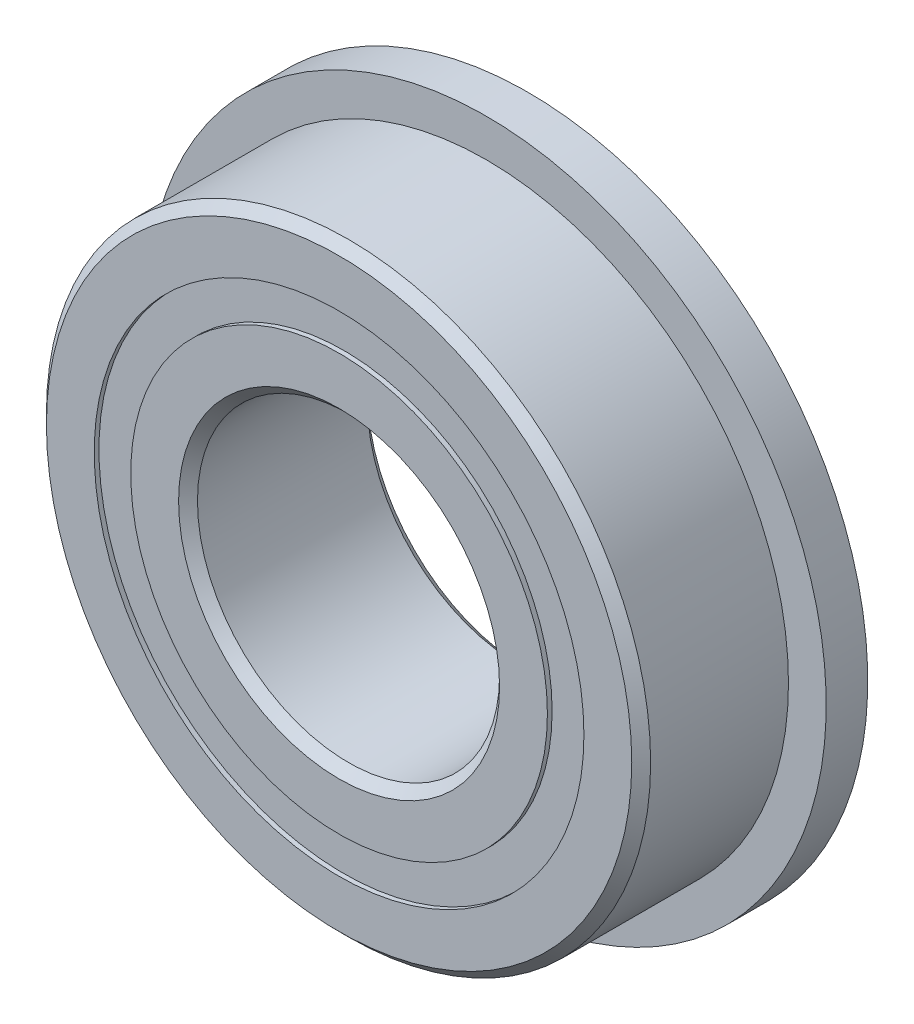
ISO-10303-21;
HEADER;
FILE_DESCRIPTION(('STEP AP214'),'2;1');
FILE_NAME('part.step','',(''),(''),'','','');
FILE_SCHEMA(('AUTOMOTIVE_DESIGN { 1 0 10303 214 1 1 1 1 }'));
ENDSEC;
DATA;
#1=APPLICATION_CONTEXT('core data for automotive mechanical design processes');
#2=APPLICATION_PROTOCOL_DEFINITION('international standard','automotive_design',2000,#1);
#3=PRODUCT_CONTEXT('',#1,'mechanical');
#4=PRODUCT('Part','Part','',(#3));
#5=PRODUCT_RELATED_PRODUCT_CATEGORY('part','',(#4));
#6=PRODUCT_DEFINITION_FORMATION('','',#4);
#7=PRODUCT_DEFINITION_CONTEXT('part definition',#1,'design');
#8=PRODUCT_DEFINITION('design','',#6,#7);
#9=PRODUCT_DEFINITION_SHAPE('','',#8);
#10=(LENGTH_UNIT() NAMED_UNIT(*) SI_UNIT(.MILLI.,.METRE.));
#11=(NAMED_UNIT(*) PLANE_ANGLE_UNIT() SI_UNIT($,.RADIAN.));
#12=(NAMED_UNIT(*) SI_UNIT($,.STERADIAN.) SOLID_ANGLE_UNIT());
#13=UNCERTAINTY_MEASURE_WITH_UNIT(LENGTH_MEASURE(1.E-05),#10,'distance_accuracy_value','');
#14=(GEOMETRIC_REPRESENTATION_CONTEXT(3) GLOBAL_UNCERTAINTY_ASSIGNED_CONTEXT((#13)) GLOBAL_UNIT_ASSIGNED_CONTEXT((#10,
#11,#12)) REPRESENTATION_CONTEXT('',''));
#15=CARTESIAN_POINT('',(0.,0.,0.));
#16=DIRECTION('',(0.,0.,1.));
#17=DIRECTION('',(1.,0.,0.));
#18=AXIS2_PLACEMENT_3D('',#15,#16,#17);
#19=CARTESIAN_POINT('',(0.,6.48351648351648,-2.375));
#20=DIRECTION('',(0.,0.,1.));
#21=DIRECTION('',(1.,0.,0.));
#22=AXIS2_PLACEMENT_3D('',#19,#20,#21);
#23=PLANE('',#22);
#24=CARTESIAN_POINT('',(0.,0.,-2.375));
#25=DIRECTION('',(0.,0.,1.));
#26=DIRECTION('',(1.,0.,0.));
#27=AXIS2_PLACEMENT_3D('',#24,#25,#26);
#28=CIRCLE('',#27,6.48351648351648);
#29=CARTESIAN_POINT('',(6.48351648351648,0.,-2.375));
#30=VERTEX_POINT('',#29);
#31=EDGE_CURVE('E61',#30,#30,#28,.T.);
#32=ORIENTED_EDGE('',*,*,#31,.F.);
#33=EDGE_LOOP('',(#32));
#34=FACE_BOUND('',#33,.T.);
#35=CARTESIAN_POINT('',(0.,0.,-2.375));
#36=DIRECTION('',(0.,0.,1.));
#37=DIRECTION('',(1.,0.,0.));
#38=AXIS2_PLACEMENT_3D('',#35,#36,#37);
#39=CIRCLE('',#38,5.51648351648352);
#40=CARTESIAN_POINT('',(5.51648351648352,0.,-2.375));
#41=VERTEX_POINT('',#40);
#42=EDGE_CURVE('E11',#41,#41,#39,.T.);
#43=ORIENTED_EDGE('',*,*,#42,.T.);
#44=EDGE_LOOP('',(#43));
#45=FACE_BOUND('',#44,.T.);
#46=ADVANCED_FACE('F47',(#34,#45),#23,.F.);
#47=CARTESIAN_POINT('',(0.,0.,2.5));
#48=DIRECTION('',(0.,0.,1.));
#49=DIRECTION('',(1.,0.,0.));
#50=AXIS2_PLACEMENT_3D('',#47,#48,#49);
#51=CYLINDRICAL_SURFACE('',#50,5.51648351648352);
#52=ORIENTED_EDGE('',*,*,#42,.F.);
#53=EDGE_LOOP('',(#52));
#54=FACE_BOUND('',#53,.T.);
#55=CARTESIAN_POINT('',(0.,0.,-1.21175743903915));
#56=DIRECTION('',(0.,0.,1.));
#57=DIRECTION('',(1.,0.,0.));
#58=AXIS2_PLACEMENT_3D('',#55,#56,#57);
#59=CIRCLE('',#58,5.51648351648352);
#60=CARTESIAN_POINT('',(5.51648351648352,0.,-1.21175743903915));
#61=VERTEX_POINT('',#60);
#62=EDGE_CURVE('E53',#61,#61,#59,.T.);
#63=ORIENTED_EDGE('',*,*,#62,.T.);
#64=EDGE_LOOP('',(#63));
#65=FACE_BOUND('',#64,.T.);
#66=ADVANCED_FACE('F70',(#54,#65),#51,.F.);
#67=CARTESIAN_POINT('',(0.,6.48351648351648,-1.21175743903915));
#68=DIRECTION('',(0.,0.,-1.));
#69=DIRECTION('',(-1.,0.,0.));
#70=AXIS2_PLACEMENT_3D('',#67,#68,#69);
#71=PLANE('',#70);
#72=ORIENTED_EDGE('',*,*,#62,.F.);
#73=EDGE_LOOP('',(#72));
#74=FACE_BOUND('',#73,.T.);
#75=CARTESIAN_POINT('',(0.,0.,-1.21175743903915));
#76=DIRECTION('',(0.,0.,1.));
#77=DIRECTION('',(1.,0.,0.));
#78=AXIS2_PLACEMENT_3D('',#75,#76,#77);
#79=CIRCLE('',#78,6.48351648351648);
#80=CARTESIAN_POINT('',(6.48351648351648,0.,-1.21175743903915));
#81=VERTEX_POINT('',#80);
#82=EDGE_CURVE('E57',#81,#81,#79,.T.);
#83=ORIENTED_EDGE('',*,*,#82,.T.);
#84=EDGE_LOOP('',(#83));
#85=FACE_BOUND('',#84,.T.);
#86=ADVANCED_FACE('F74',(#74,#85),#71,.F.);
#87=CARTESIAN_POINT('',(0.,0.,2.5));
#88=DIRECTION('',(0.,0.,1.));
#89=DIRECTION('',(1.,0.,0.));
#90=AXIS2_PLACEMENT_3D('',#87,#88,#89);
#91=CYLINDRICAL_SURFACE('',#90,6.48351648351648);
#92=ORIENTED_EDGE('',*,*,#82,.F.);
#93=EDGE_LOOP('',(#92));
#94=FACE_BOUND('',#93,.T.);
#95=ORIENTED_EDGE('',*,*,#31,.T.);
#96=EDGE_LOOP('',(#95));
#97=FACE_BOUND('',#96,.T.);
#98=ADVANCED_FACE('F67',(#94,#97),#91,.T.);
#99=CLOSED_SHELL('',(#46,#66,#86,#98));
#100=MANIFOLD_SOLID_BREP('B2',#99);
#101=CARTESIAN_POINT('',(0.,6.48351648351648,2.375));
#102=DIRECTION('',(0.,0.,-1.));
#103=DIRECTION('',(-1.,0.,0.));
#104=AXIS2_PLACEMENT_3D('',#101,#102,#103);
#105=PLANE('',#104);
#106=CARTESIAN_POINT('',(0.,0.,2.375));
#107=DIRECTION('',(0.,0.,1.));
#108=DIRECTION('',(1.,0.,0.));
#109=AXIS2_PLACEMENT_3D('',#106,#107,#108);
#110=CIRCLE('',#109,5.51648351648352);
#111=CARTESIAN_POINT('',(5.51648351648352,0.,2.375));
#112=VERTEX_POINT('',#111);
#113=EDGE_CURVE('E46',#112,#112,#110,.T.);
#114=ORIENTED_EDGE('',*,*,#113,.F.);
#115=EDGE_LOOP('',(#114));
#116=FACE_BOUND('',#115,.T.);
#117=CARTESIAN_POINT('',(0.,0.,2.375));
#118=DIRECTION('',(0.,0.,1.));
#119=DIRECTION('',(1.,0.,0.));
#120=AXIS2_PLACEMENT_3D('',#117,#118,#119);
#121=CIRCLE('',#120,6.48351648351648);
#122=CARTESIAN_POINT('',(6.48351648351648,0.,2.375));
#123=VERTEX_POINT('',#122);
#124=EDGE_CURVE('E129',#123,#123,#121,.T.);
#125=ORIENTED_EDGE('',*,*,#124,.T.);
#126=EDGE_LOOP('',(#125));
#127=FACE_BOUND('',#126,.T.);
#128=ADVANCED_FACE('F115',(#116,#127),#105,.F.);
#129=CARTESIAN_POINT('',(0.,0.,2.5));
#130=DIRECTION('',(0.,0.,1.));
#131=DIRECTION('',(1.,0.,0.));
#132=AXIS2_PLACEMENT_3D('',#129,#130,#131);
#133=CYLINDRICAL_SURFACE('',#132,5.51648351648352);
#134=CARTESIAN_POINT('',(0.,0.,1.21175743903915));
#135=DIRECTION('',(0.,0.,1.));
#136=DIRECTION('',(1.,0.,0.));
#137=AXIS2_PLACEMENT_3D('',#134,#135,#136);
#138=CIRCLE('',#137,5.51648351648352);
#139=CARTESIAN_POINT('',(5.51648351648352,0.,1.21175743903915));
#140=VERTEX_POINT('',#139);
#141=EDGE_CURVE('E121',#140,#140,#138,.T.);
#142=ORIENTED_EDGE('',*,*,#141,.F.);
#143=EDGE_LOOP('',(#142));
#144=FACE_BOUND('',#143,.T.);
#145=ORIENTED_EDGE('',*,*,#113,.T.);
#146=EDGE_LOOP('',(#145));
#147=FACE_BOUND('',#146,.T.);
#148=ADVANCED_FACE('F144',(#144,#147),#133,.F.);
#149=CARTESIAN_POINT('',(0.,6.48351648351648,1.21175743903915));
#150=DIRECTION('',(0.,0.,1.));
#151=DIRECTION('',(1.,0.,0.));
#152=AXIS2_PLACEMENT_3D('',#149,#150,#151);
#153=PLANE('',#152);
#154=CARTESIAN_POINT('',(0.,0.,1.21175743903915));
#155=DIRECTION('',(0.,0.,1.));
#156=DIRECTION('',(1.,0.,0.));
#157=AXIS2_PLACEMENT_3D('',#154,#155,#156);
#158=CIRCLE('',#157,6.48351648351648);
#159=CARTESIAN_POINT('',(6.48351648351648,0.,1.21175743903915));
#160=VERTEX_POINT('',#159);
#161=EDGE_CURVE('E125',#160,#160,#158,.T.);
#162=ORIENTED_EDGE('',*,*,#161,.F.);
#163=EDGE_LOOP('',(#162));
#164=FACE_BOUND('',#163,.T.);
#165=ORIENTED_EDGE('',*,*,#141,.T.);
#166=EDGE_LOOP('',(#165));
#167=FACE_BOUND('',#166,.T.);
#168=ADVANCED_FACE('F139',(#164,#167),#153,.F.);
#169=CARTESIAN_POINT('',(0.,0.,2.5));
#170=DIRECTION('',(0.,0.,1.));
#171=DIRECTION('',(1.,0.,0.));
#172=AXIS2_PLACEMENT_3D('',#169,#170,#171);
#173=CYLINDRICAL_SURFACE('',#172,6.48351648351648);
#174=ORIENTED_EDGE('',*,*,#124,.F.);
#175=EDGE_LOOP('',(#174));
#176=FACE_BOUND('',#175,.T.);
#177=ORIENTED_EDGE('',*,*,#161,.T.);
#178=EDGE_LOOP('',(#177));
#179=FACE_BOUND('',#178,.T.);
#180=ADVANCED_FACE('F136',(#176,#179),#173,.T.);
#181=CLOSED_SHELL('',(#128,#148,#168,#180));
#182=MANIFOLD_SOLID_BREP('B6',#181);
#183=CARTESIAN_POINT('',(-2.99999999999993,5.19615242270667,0.));
#184=DIRECTION('',(0.,0.,1.));
#185=DIRECTION('',(-0.499999999999989,0.866025403784445,0.));
#186=AXIS2_PLACEMENT_3D('',#183,#184,#185);
#187=SPHERICAL_SURFACE('',#186,1.21175743903915);
#188=CARTESIAN_POINT('',(-2.99999999999993,5.19615242270667,1.21175743903915));
#189=VERTEX_POINT('',#188);
#190=VERTEX_LOOP('',#189);
#191=FACE_BOUND('',#190,.T.);
#192=ADVANCED_FACE('F186',(#191),#187,.T.);
#193=CLOSED_SHELL('',(#192));
#194=MANIFOLD_SOLID_BREP('B41',#193);
#195=CARTESIAN_POINT('',(-5.1961524227066,3.00000000000006,0.));
#196=DIRECTION('',(0.,0.,1.));
#197=DIRECTION('',(-0.866025403784433,0.50000000000001,0.));
#198=AXIS2_PLACEMENT_3D('',#195,#196,#197);
#199=SPHERICAL_SURFACE('',#198,1.21175743903915);
#200=CARTESIAN_POINT('',(-5.1961524227066,3.00000000000006,1.21175743903915));
#201=VERTEX_POINT('',#200);
#202=VERTEX_LOOP('',#201);
#203=FACE_BOUND('',#202,.T.);
#204=ADVANCED_FACE('F211',(#203),#199,.T.);
#205=CLOSED_SHELL('',(#204));
#206=MANIFOLD_SOLID_BREP('B111',#205);
#207=CARTESIAN_POINT('',(-6.,0.,0.));
#208=DIRECTION('',(0.,0.,1.));
#209=DIRECTION('',(-1.,0.,0.));
#210=AXIS2_PLACEMENT_3D('',#207,#208,#209);
#211=SPHERICAL_SURFACE('',#210,1.21175743903915);
#212=CARTESIAN_POINT('',(-6.,0.,1.21175743903915));
#213=VERTEX_POINT('',#212);
#214=VERTEX_LOOP('',#213);
#215=FACE_BOUND('',#214,.T.);
#216=ADVANCED_FACE('F235',(#215),#211,.T.);
#217=CLOSED_SHELL('',(#216));
#218=MANIFOLD_SOLID_BREP('B182',#217);
#219=CARTESIAN_POINT('',(-5.19615242270666,-2.99999999999995,0.));
#220=DIRECTION('',(0.,0.,1.));
#221=DIRECTION('',(-0.866025403784443,-0.499999999999992,0.));
#222=AXIS2_PLACEMENT_3D('',#219,#220,#221);
#223=SPHERICAL_SURFACE('',#222,1.21175743903915);
#224=CARTESIAN_POINT('',(-5.19615242270666,-2.99999999999995,1.21175743903915));
#225=VERTEX_POINT('',#224);
#226=VERTEX_LOOP('',#225);
#227=FACE_BOUND('',#226,.T.);
#228=ADVANCED_FACE('F260',(#227),#223,.T.);
#229=CLOSED_SHELL('',(#228));
#230=MANIFOLD_SOLID_BREP('B207',#229);
#231=CARTESIAN_POINT('',(-3.00000000000004,-5.19615242270661,0.));
#232=DIRECTION('',(0.,0.,1.));
#233=DIRECTION('',(-0.500000000000007,-0.866025403784435,0.));
#234=AXIS2_PLACEMENT_3D('',#231,#232,#233);
#235=SPHERICAL_SURFACE('',#234,1.21175743903915);
#236=CARTESIAN_POINT('',(-3.00000000000004,-5.19615242270661,1.21175743903915));
#237=VERTEX_POINT('',#236);
#238=VERTEX_LOOP('',#237);
#239=FACE_BOUND('',#238,.T.);
#240=ADVANCED_FACE('F285',(#239),#235,.T.);
#241=CLOSED_SHELL('',(#240));
#242=MANIFOLD_SOLID_BREP('B231',#241);
#243=CARTESIAN_POINT('',(0.,-6.,0.));
#244=DIRECTION('',(0.,0.,1.));
#245=DIRECTION('',(0.,-1.,0.));
#246=AXIS2_PLACEMENT_3D('',#243,#244,#245);
#247=SPHERICAL_SURFACE('',#246,1.21175743903915);
#248=CARTESIAN_POINT('',(0.,-6.,1.21175743903915));
#249=VERTEX_POINT('',#248);
#250=VERTEX_LOOP('',#249);
#251=FACE_BOUND('',#250,.T.);
#252=ADVANCED_FACE('F310',(#251),#247,.T.);
#253=CLOSED_SHELL('',(#252));
#254=MANIFOLD_SOLID_BREP('B256',#253);
#255=CARTESIAN_POINT('',(2.99999999999997,-5.19615242270665,0.));
#256=DIRECTION('',(0.,0.,1.));
#257=DIRECTION('',(0.499999999999995,-0.866025403784442,0.));
#258=AXIS2_PLACEMENT_3D('',#255,#256,#257);
#259=SPHERICAL_SURFACE('',#258,1.21175743903915);
#260=CARTESIAN_POINT('',(2.99999999999997,-5.19615242270665,1.21175743903915));
#261=VERTEX_POINT('',#260);
#262=VERTEX_LOOP('',#261);
#263=FACE_BOUND('',#262,.T.);
#264=ADVANCED_FACE('F334',(#263),#259,.T.);
#265=CLOSED_SHELL('',(#264));
#266=MANIFOLD_SOLID_BREP('B281',#265);
#267=CARTESIAN_POINT('',(5.19615242270662,-3.00000000000002,0.));
#268=DIRECTION('',(0.,0.,1.));
#269=DIRECTION('',(0.866025403784436,-0.500000000000004,0.));
#270=AXIS2_PLACEMENT_3D('',#267,#268,#269);
#271=SPHERICAL_SURFACE('',#270,1.21175743903915);
#272=CARTESIAN_POINT('',(5.19615242270662,-3.00000000000002,1.21175743903915));
#273=VERTEX_POINT('',#272);
#274=VERTEX_LOOP('',#273);
#275=FACE_BOUND('',#274,.T.);
#276=ADVANCED_FACE('F359',(#275),#271,.T.);
#277=CLOSED_SHELL('',(#276));
#278=MANIFOLD_SOLID_BREP('B306',#277);
#279=CARTESIAN_POINT('',(6.,0.,0.));
#280=DIRECTION('',(0.,0.,1.));
#281=DIRECTION('',(1.,0.,0.));
#282=AXIS2_PLACEMENT_3D('',#279,#280,#281);
#283=SPHERICAL_SURFACE('',#282,1.21175743903915);
#284=CARTESIAN_POINT('',(6.,0.,1.21175743903915));
#285=VERTEX_POINT('',#284);
#286=VERTEX_LOOP('',#285);
#287=FACE_BOUND('',#286,.T.);
#288=ADVANCED_FACE('F384',(#287),#283,.T.);
#289=CLOSED_SHELL('',(#288));
#290=MANIFOLD_SOLID_BREP('B330',#289);
#291=CARTESIAN_POINT('',(5.19615242270664,2.99999999999999,0.));
#292=DIRECTION('',(0.,0.,1.));
#293=DIRECTION('',(0.86602540378444,0.499999999999998,0.));
#294=AXIS2_PLACEMENT_3D('',#291,#292,#293);
#295=SPHERICAL_SURFACE('',#294,1.21175743903915);
#296=CARTESIAN_POINT('',(5.19615242270664,2.99999999999999,1.21175743903915));
#297=VERTEX_POINT('',#296);
#298=VERTEX_LOOP('',#297);
#299=FACE_BOUND('',#298,.T.);
#300=ADVANCED_FACE('F409',(#299),#295,.T.);
#301=CLOSED_SHELL('',(#300));
#302=MANIFOLD_SOLID_BREP('B355',#301);
#303=CARTESIAN_POINT('',(3.00000000000001,5.19615242270663,0.));
#304=DIRECTION('',(0.,0.,1.));
#305=DIRECTION('',(0.500000000000001,0.866025403784438,0.));
#306=AXIS2_PLACEMENT_3D('',#303,#304,#305);
#307=SPHERICAL_SURFACE('',#306,1.21175743903915);
#308=CARTESIAN_POINT('',(3.00000000000001,5.19615242270663,1.21175743903915));
#309=VERTEX_POINT('',#308);
#310=VERTEX_LOOP('',#309);
#311=FACE_BOUND('',#310,.T.);
#312=ADVANCED_FACE('F434',(#311),#307,.T.);
#313=CLOSED_SHELL('',(#312));
#314=MANIFOLD_SOLID_BREP('B380',#313);
#315=CARTESIAN_POINT('',(0.,6.,0.));
#316=DIRECTION('',(0.,0.,1.));
#317=DIRECTION('',(0.,1.,0.));
#318=AXIS2_PLACEMENT_3D('',#315,#316,#317);
#319=SPHERICAL_SURFACE('',#318,1.21175743903915);
#320=CARTESIAN_POINT('',(0.,6.,1.21175743903915));
#321=VERTEX_POINT('',#320);
#322=VERTEX_LOOP('',#321);
#323=FACE_BOUND('',#322,.T.);
#324=ADVANCED_FACE('F461',(#323),#319,.T.);
#325=CLOSED_SHELL('',(#324));
#326=MANIFOLD_SOLID_BREP('B405',#325);
#327=CARTESIAN_POINT('',(0.,5.51648351648352,2.5));
#328=DIRECTION('',(0.,0.,-1.));
#329=DIRECTION('',(-1.,0.,0.));
#330=AXIS2_PLACEMENT_3D('',#327,#328,#329);
#331=PLANE('',#330);
#332=CARTESIAN_POINT('',(0.,0.,2.5));
#333=DIRECTION('',(0.,0.,1.));
#334=DIRECTION('',(1.,0.,0.));
#335=AXIS2_PLACEMENT_3D('',#332,#333,#334);
#336=CIRCLE('',#335,4.25);
#337=CARTESIAN_POINT('',(4.25,0.,2.5));
#338=VERTEX_POINT('',#337);
#339=EDGE_CURVE('E513',#338,#338,#336,.T.);
#340=ORIENTED_EDGE('',*,*,#339,.F.);
#341=EDGE_LOOP('',(#340));
#342=FACE_BOUND('',#341,.T.);
#343=CARTESIAN_POINT('',(0.,0.,2.5));
#344=DIRECTION('',(0.,0.,1.));
#345=DIRECTION('',(1.,0.,0.));
#346=AXIS2_PLACEMENT_3D('',#343,#344,#345);
#347=CIRCLE('',#346,5.51648351648352);
#348=CARTESIAN_POINT('',(5.51648351648352,0.,2.5));
#349=VERTEX_POINT('',#348);
#350=EDGE_CURVE('E460',#349,#349,#347,.T.);
#351=ORIENTED_EDGE('',*,*,#350,.T.);
#352=EDGE_LOOP('',(#351));
#353=FACE_BOUND('',#352,.T.);
#354=ADVANCED_FACE('F485',(#342,#353),#331,.F.);
#355=CARTESIAN_POINT('',(0.,0.,2.5));
#356=DIRECTION('',(0.,0.,1.));
#357=DIRECTION('',(1.,0.,0.));
#358=AXIS2_PLACEMENT_3D('',#355,#356,#357);
#359=CYLINDRICAL_SURFACE('',#358,5.51648351648352);
#360=ORIENTED_EDGE('',*,*,#350,.F.);
#361=EDGE_LOOP('',(#360));
#362=FACE_BOUND('',#361,.T.);
#363=CARTESIAN_POINT('',(0.,0.,1.11111111111111));
#364=DIRECTION('',(0.,0.,1.));
#365=DIRECTION('',(1.,0.,0.));
#366=AXIS2_PLACEMENT_3D('',#363,#364,#365);
#367=CIRCLE('',#366,5.51648351648352);
#368=CARTESIAN_POINT('',(5.51648351648352,0.,1.11111111111111));
#369=VERTEX_POINT('',#368);
#370=EDGE_CURVE('E491',#369,#369,#367,.T.);
#371=ORIENTED_EDGE('',*,*,#370,.T.);
#372=EDGE_LOOP('',(#371));
#373=FACE_BOUND('',#372,.T.);
#374=ADVANCED_FACE('F520',(#362,#373),#359,.T.);
#375=CARTESIAN_POINT('',(0.,0.,0.));
#376=DIRECTION('',(0.,0.,1.));
#377=DIRECTION('',(1.,0.,0.));
#378=AXIS2_PLACEMENT_3D('',#375,#376,#377);
#379=TOROIDAL_SURFACE('',#378,6.,1.21175743903915);
#380=ORIENTED_EDGE('',*,*,#370,.F.);
#381=EDGE_LOOP('',(#380));
#382=FACE_BOUND('',#381,.T.);
#383=CARTESIAN_POINT('',(0.,0.,-1.11111111111111));
#384=DIRECTION('',(0.,0.,1.));
#385=DIRECTION('',(1.,0.,0.));
#386=AXIS2_PLACEMENT_3D('',#383,#384,#385);
#387=CIRCLE('',#386,5.51648351648352);
#388=CARTESIAN_POINT('',(5.51648351648352,0.,-1.11111111111111));
#389=VERTEX_POINT('',#388);
#390=EDGE_CURVE('E495',#389,#389,#387,.T.);
#391=ORIENTED_EDGE('',*,*,#390,.T.);
#392=EDGE_LOOP('',(#391));
#393=FACE_BOUND('',#392,.T.);
#394=ADVANCED_FACE('F524',(#382,#393),#379,.F.);
#395=CARTESIAN_POINT('',(0.,0.,2.5));
#396=DIRECTION('',(0.,0.,1.));
#397=DIRECTION('',(1.,0.,0.));
#398=AXIS2_PLACEMENT_3D('',#395,#396,#397);
#399=CYLINDRICAL_SURFACE('',#398,5.51648351648352);
#400=ORIENTED_EDGE('',*,*,#390,.F.);
#401=EDGE_LOOP('',(#400));
#402=FACE_BOUND('',#401,.T.);
#403=CARTESIAN_POINT('',(0.,0.,-2.5));
#404=DIRECTION('',(0.,0.,1.));
#405=DIRECTION('',(1.,0.,0.));
#406=AXIS2_PLACEMENT_3D('',#403,#404,#405);
#407=CIRCLE('',#406,5.51648351648352);
#408=CARTESIAN_POINT('',(5.51648351648352,0.,-2.5));
#409=VERTEX_POINT('',#408);
#410=EDGE_CURVE('E499',#409,#409,#407,.T.);
#411=ORIENTED_EDGE('',*,*,#410,.T.);
#412=EDGE_LOOP('',(#411));
#413=FACE_BOUND('',#412,.T.);
#414=ADVANCED_FACE('F529',(#402,#413),#399,.T.);
#415=CARTESIAN_POINT('',(0.,4.25,-2.5));
#416=DIRECTION('',(0.,0.,1.));
#417=DIRECTION('',(1.,0.,0.));
#418=AXIS2_PLACEMENT_3D('',#415,#416,#417);
#419=PLANE('',#418);
#420=ORIENTED_EDGE('',*,*,#410,.F.);
#421=EDGE_LOOP('',(#420));
#422=FACE_BOUND('',#421,.T.);
#423=CARTESIAN_POINT('',(0.,0.,-2.5));
#424=DIRECTION('',(0.,0.,1.));
#425=DIRECTION('',(1.,0.,0.));
#426=AXIS2_PLACEMENT_3D('',#423,#424,#425);
#427=CIRCLE('',#426,4.25);
#428=CARTESIAN_POINT('',(4.25,0.,-2.5));
#429=VERTEX_POINT('',#428);
#430=EDGE_CURVE('E504',#429,#429,#427,.T.);
#431=ORIENTED_EDGE('',*,*,#430,.T.);
#432=EDGE_LOOP('',(#431));
#433=FACE_BOUND('',#432,.T.);
#434=ADVANCED_FACE('F535',(#422,#433),#419,.F.);
#435=CARTESIAN_POINT('',(0.,0.,-2.25));
#436=DIRECTION('',(0.,0.,-1.));
#437=DIRECTION('',(-1.,0.,0.));
#438=AXIS2_PLACEMENT_3D('',#435,#436,#437);
#439=CONICAL_SURFACE('',#438,4.,0.785398163397443);
#440=ORIENTED_EDGE('',*,*,#430,.F.);
#441=EDGE_LOOP('',(#440));
#442=FACE_BOUND('',#441,.T.);
#443=CARTESIAN_POINT('',(0.,0.,-2.25));
#444=DIRECTION('',(0.,0.,1.));
#445=DIRECTION('',(1.,0.,0.));
#446=AXIS2_PLACEMENT_3D('',#443,#444,#445);
#447=CIRCLE('',#446,4.);
#448=CARTESIAN_POINT('',(4.,0.,-2.25));
#449=VERTEX_POINT('',#448);
#450=EDGE_CURVE('E507',#449,#449,#447,.T.);
#451=ORIENTED_EDGE('',*,*,#450,.T.);
#452=EDGE_LOOP('',(#451));
#453=FACE_BOUND('',#452,.T.);
#454=ADVANCED_FACE('F539',(#442,#453),#439,.F.);
#455=CARTESIAN_POINT('',(0.,0.,2.5));
#456=DIRECTION('',(0.,0.,1.));
#457=DIRECTION('',(1.,0.,0.));
#458=AXIS2_PLACEMENT_3D('',#455,#456,#457);
#459=CYLINDRICAL_SURFACE('',#458,4.);
#460=ORIENTED_EDGE('',*,*,#450,.F.);
#461=EDGE_LOOP('',(#460));
#462=FACE_BOUND('',#461,.T.);
#463=CARTESIAN_POINT('',(0.,0.,2.25));
#464=DIRECTION('',(0.,0.,1.));
#465=DIRECTION('',(1.,0.,0.));
#466=AXIS2_PLACEMENT_3D('',#463,#464,#465);
#467=CIRCLE('',#466,4.);
#468=CARTESIAN_POINT('',(4.,0.,2.25));
#469=VERTEX_POINT('',#468);
#470=EDGE_CURVE('E510',#469,#469,#467,.T.);
#471=ORIENTED_EDGE('',*,*,#470,.T.);
#472=EDGE_LOOP('',(#471));
#473=FACE_BOUND('',#472,.T.);
#474=ADVANCED_FACE('F543',(#462,#473),#459,.F.);
#475=CARTESIAN_POINT('',(0.,0.,2.5));
#476=DIRECTION('',(0.,0.,1.));
#477=DIRECTION('',(1.,0.,0.));
#478=AXIS2_PLACEMENT_3D('',#475,#476,#477);
#479=CONICAL_SURFACE('',#478,4.25,0.785398163397455);
#480=ORIENTED_EDGE('',*,*,#470,.F.);
#481=EDGE_LOOP('',(#480));
#482=FACE_BOUND('',#481,.T.);
#483=ORIENTED_EDGE('',*,*,#339,.T.);
#484=EDGE_LOOP('',(#483));
#485=FACE_BOUND('',#484,.T.);
#486=ADVANCED_FACE('F517',(#482,#485),#479,.F.);
#487=CLOSED_SHELL('',(#354,#374,#394,#414,#434,#454,#474,#486));
#488=MANIFOLD_SOLID_BREP('B430',#487);
#489=CARTESIAN_POINT('',(0.,0.,2.25));
#490=DIRECTION('',(0.,0.,-1.));
#491=DIRECTION('',(-1.,0.,0.));
#492=AXIS2_PLACEMENT_3D('',#489,#490,#491);
#493=CONICAL_SURFACE('',#492,8.,0.785398163397446);
#494=CARTESIAN_POINT('',(0.,0.,2.5));
#495=DIRECTION('',(0.,0.,1.));
#496=DIRECTION('',(1.,0.,0.));
#497=AXIS2_PLACEMENT_3D('',#494,#495,#496);
#498=CIRCLE('',#497,7.75);
#499=CARTESIAN_POINT('',(7.75,0.,2.5));
#500=VERTEX_POINT('',#499);
#501=EDGE_CURVE('E632',#500,#500,#498,.T.);
#502=ORIENTED_EDGE('',*,*,#501,.F.);
#503=EDGE_LOOP('',(#502));
#504=FACE_BOUND('',#503,.T.);
#505=CARTESIAN_POINT('',(0.,0.,2.25));
#506=DIRECTION('',(0.,0.,1.));
#507=DIRECTION('',(1.,0.,0.));
#508=AXIS2_PLACEMENT_3D('',#505,#506,#507);
#509=CIRCLE('',#508,8.);
#510=CARTESIAN_POINT('',(8.,0.,2.25));
#511=VERTEX_POINT('',#510);
#512=EDGE_CURVE('E484',#511,#511,#509,.T.);
#513=ORIENTED_EDGE('',*,*,#512,.T.);
#514=EDGE_LOOP('',(#513));
#515=FACE_BOUND('',#514,.T.);
#516=ADVANCED_FACE('F610',(#504,#515),#493,.T.);
#517=CARTESIAN_POINT('',(0.,0.,2.5));
#518=DIRECTION('',(0.,0.,1.));
#519=DIRECTION('',(1.,0.,0.));
#520=AXIS2_PLACEMENT_3D('',#517,#518,#519);
#521=CYLINDRICAL_SURFACE('',#520,8.);
#522=CARTESIAN_POINT('',(0.,0.,-1.4));
#523=DIRECTION('',(0.,0.,1.));
#524=DIRECTION('',(1.,0.,0.));
#525=AXIS2_PLACEMENT_3D('',#522,#523,#524);
#526=CIRCLE('',#525,8.);
#527=CARTESIAN_POINT('',(8.,0.,-1.4));
#528=VERTEX_POINT('',#527);
#529=EDGE_CURVE('E635',#528,#528,#526,.T.);
#530=ORIENTED_EDGE('',*,*,#529,.T.);
#531=EDGE_LOOP('',(#530));
#532=FACE_BOUND('',#531,.T.);
#533=ORIENTED_EDGE('',*,*,#512,.F.);
#534=EDGE_LOOP('',(#533));
#535=FACE_BOUND('',#534,.T.);
#536=ADVANCED_FACE('F655',(#532,#535),#521,.T.);
#537=CARTESIAN_POINT('',(0.,7.75,-2.5));
#538=DIRECTION('',(0.,0.,1.));
#539=DIRECTION('',(1.,0.,0.));
#540=AXIS2_PLACEMENT_3D('',#537,#538,#539);
#541=PLANE('',#540);
#542=CARTESIAN_POINT('',(0.,0.,-2.5));
#543=DIRECTION('',(0.,0.,1.));
#544=DIRECTION('',(1.,0.,0.));
#545=AXIS2_PLACEMENT_3D('',#542,#543,#544);
#546=CIRCLE('',#545,6.48351648351648);
#547=CARTESIAN_POINT('',(6.48351648351648,0.,-2.5));
#548=VERTEX_POINT('',#547);
#549=EDGE_CURVE('E616',#548,#548,#546,.T.);
#550=ORIENTED_EDGE('',*,*,#549,.T.);
#551=EDGE_LOOP('',(#550));
#552=FACE_BOUND('',#551,.T.);
#553=CARTESIAN_POINT('',(0.,0.,-2.5));
#554=DIRECTION('',(0.,0.,-1.));
#555=DIRECTION('',(-1.,0.,0.));
#556=AXIS2_PLACEMENT_3D('',#553,#554,#555);
#557=CIRCLE('',#556,9.);
#558=CARTESIAN_POINT('',(-9.,0.,-2.5));
#559=VERTEX_POINT('',#558);
#560=EDGE_CURVE('E638',#559,#559,#557,.T.);
#561=ORIENTED_EDGE('',*,*,#560,.T.);
#562=EDGE_LOOP('',(#561));
#563=FACE_BOUND('',#562,.T.);
#564=ADVANCED_FACE('F658',(#552,#563),#541,.F.);
#565=CARTESIAN_POINT('',(0.,0.,2.5));
#566=DIRECTION('',(0.,0.,1.));
#567=DIRECTION('',(1.,0.,0.));
#568=AXIS2_PLACEMENT_3D('',#565,#566,#567);
#569=CYLINDRICAL_SURFACE('',#568,6.48351648351648);
#570=CARTESIAN_POINT('',(0.,0.,-1.11111111111111));
#571=DIRECTION('',(0.,0.,1.));
#572=DIRECTION('',(1.,0.,0.));
#573=AXIS2_PLACEMENT_3D('',#570,#571,#572);
#574=CIRCLE('',#573,6.48351648351648);
#575=CARTESIAN_POINT('',(6.48351648351648,0.,-1.11111111111111));
#576=VERTEX_POINT('',#575);
#577=EDGE_CURVE('E620',#576,#576,#574,.T.);
#578=ORIENTED_EDGE('',*,*,#577,.T.);
#579=EDGE_LOOP('',(#578));
#580=FACE_BOUND('',#579,.T.);
#581=ORIENTED_EDGE('',*,*,#549,.F.);
#582=EDGE_LOOP('',(#581));
#583=FACE_BOUND('',#582,.T.);
#584=ADVANCED_FACE('F663',(#580,#583),#569,.F.);
#585=CARTESIAN_POINT('',(0.,0.,0.));
#586=DIRECTION('',(0.,0.,1.));
#587=DIRECTION('',(1.,0.,0.));
#588=AXIS2_PLACEMENT_3D('',#585,#586,#587);
#589=TOROIDAL_SURFACE('',#588,6.,1.21175743903915);
#590=ORIENTED_EDGE('',*,*,#577,.F.);
#591=EDGE_LOOP('',(#590));
#592=FACE_BOUND('',#591,.T.);
#593=CARTESIAN_POINT('',(0.,0.,1.11111111111111));
#594=DIRECTION('',(0.,0.,1.));
#595=DIRECTION('',(1.,0.,0.));
#596=AXIS2_PLACEMENT_3D('',#593,#594,#595);
#597=CIRCLE('',#596,6.48351648351648);
#598=CARTESIAN_POINT('',(6.48351648351648,0.,1.11111111111111));
#599=VERTEX_POINT('',#598);
#600=EDGE_CURVE('E624',#599,#599,#597,.T.);
#601=ORIENTED_EDGE('',*,*,#600,.T.);
#602=EDGE_LOOP('',(#601));
#603=FACE_BOUND('',#602,.T.);
#604=ADVANCED_FACE('F669',(#592,#603),#589,.F.);
#605=CARTESIAN_POINT('',(0.,0.,2.5));
#606=DIRECTION('',(0.,0.,1.));
#607=DIRECTION('',(1.,0.,0.));
#608=AXIS2_PLACEMENT_3D('',#605,#606,#607);
#609=CYLINDRICAL_SURFACE('',#608,6.48351648351648);
#610=ORIENTED_EDGE('',*,*,#600,.F.);
#611=EDGE_LOOP('',(#610));
#612=FACE_BOUND('',#611,.T.);
#613=CARTESIAN_POINT('',(0.,0.,2.5));
#614=DIRECTION('',(0.,0.,1.));
#615=DIRECTION('',(1.,0.,0.));
#616=AXIS2_PLACEMENT_3D('',#613,#614,#615);
#617=CIRCLE('',#616,6.48351648351648);
#618=CARTESIAN_POINT('',(6.48351648351648,0.,2.5));
#619=VERTEX_POINT('',#618);
#620=EDGE_CURVE('E629',#619,#619,#617,.T.);
#621=ORIENTED_EDGE('',*,*,#620,.T.);
#622=EDGE_LOOP('',(#621));
#623=FACE_BOUND('',#622,.T.);
#624=ADVANCED_FACE('F673',(#612,#623),#609,.F.);
#625=CARTESIAN_POINT('',(0.,7.75,2.5));
#626=DIRECTION('',(0.,0.,-1.));
#627=DIRECTION('',(-1.,0.,0.));
#628=AXIS2_PLACEMENT_3D('',#625,#626,#627);
#629=PLANE('',#628);
#630=ORIENTED_EDGE('',*,*,#620,.F.);
#631=EDGE_LOOP('',(#630));
#632=FACE_BOUND('',#631,.T.);
#633=ORIENTED_EDGE('',*,*,#501,.T.);
#634=EDGE_LOOP('',(#633));
#635=FACE_BOUND('',#634,.T.);
#636=ADVANCED_FACE('F651',(#632,#635),#629,.F.);
#637=CARTESIAN_POINT('',(0.,6.48351648351648,-1.4));
#638=DIRECTION('',(0.,0.,1.));
#639=DIRECTION('',(1.,0.,0.));
#640=AXIS2_PLACEMENT_3D('',#637,#638,#639);
#641=PLANE('',#640);
#642=CARTESIAN_POINT('',(0.,0.,-1.4));
#643=DIRECTION('',(0.,0.,-1.));
#644=DIRECTION('',(-1.,0.,0.));
#645=AXIS2_PLACEMENT_3D('',#642,#643,#644);
#646=CIRCLE('',#645,9.);
#647=CARTESIAN_POINT('',(-9.,0.,-1.4));
#648=VERTEX_POINT('',#647);
#649=EDGE_CURVE('E641',#648,#648,#646,.T.);
#650=ORIENTED_EDGE('',*,*,#649,.F.);
#651=EDGE_LOOP('',(#650));
#652=FACE_BOUND('',#651,.T.);
#653=ORIENTED_EDGE('',*,*,#529,.F.);
#654=EDGE_LOOP('',(#653));
#655=FACE_BOUND('',#654,.T.);
#656=ADVANCED_FACE('F648',(#652,#655),#641,.T.);
#657=CARTESIAN_POINT('',(0.,0.,-2.5));
#658=DIRECTION('',(0.,0.,-1.));
#659=DIRECTION('',(-1.,0.,0.));
#660=AXIS2_PLACEMENT_3D('',#657,#658,#659);
#661=CYLINDRICAL_SURFACE('',#660,9.);
#662=ORIENTED_EDGE('',*,*,#649,.T.);
#663=EDGE_LOOP('',(#662));
#664=FACE_BOUND('',#663,.T.);
#665=ORIENTED_EDGE('',*,*,#560,.F.);
#666=EDGE_LOOP('',(#665));
#667=FACE_BOUND('',#666,.T.);
#668=ADVANCED_FACE('F645',(#664,#667),#661,.T.);
#669=CLOSED_SHELL('',(#516,#536,#564,#584,#604,#624,#636,#656,#668));
#670=MANIFOLD_SOLID_BREP('B455',#669);
#671=ADVANCED_BREP_SHAPE_REPRESENTATION('',(#18,#100,#182,#194,#206,#218,#230,#242,#254,#266,
#278,#290,#302,#314,#326,#488,#670),#14);
#672=SHAPE_DEFINITION_REPRESENTATION(#9,#671);
ENDSEC;
END-ISO-10303-21;
